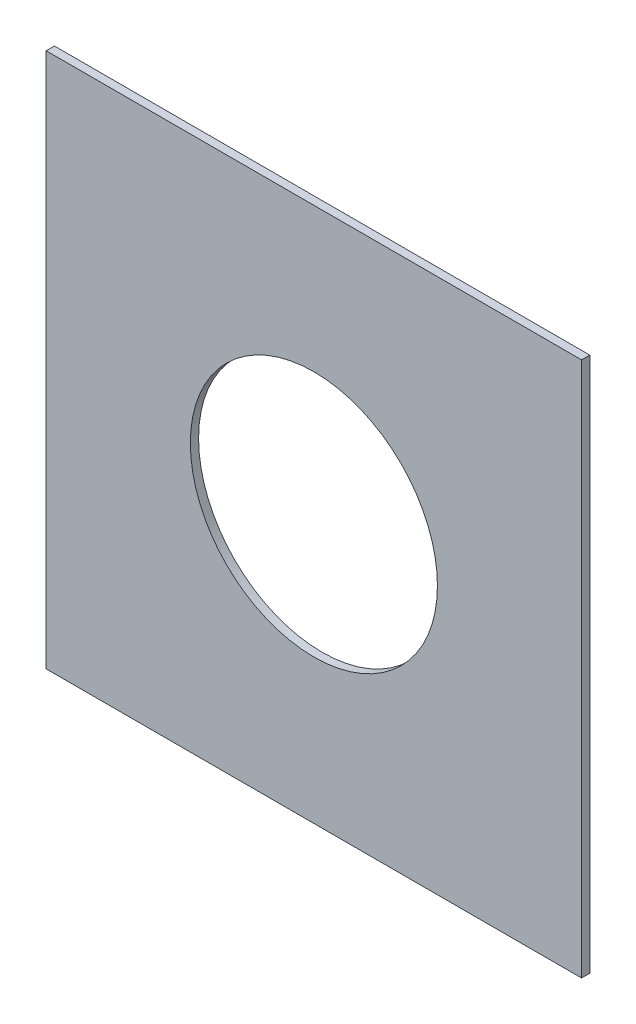
ISO-10303-21;
HEADER;
FILE_DESCRIPTION(('STEP AP214'),'2;1');
FILE_NAME('part.step','',(''),(''),'','','');
FILE_SCHEMA(('AUTOMOTIVE_DESIGN { 1 0 10303 214 1 1 1 1 }'));
ENDSEC;
DATA;
#1=APPLICATION_CONTEXT('core data for automotive mechanical design processes');
#2=APPLICATION_PROTOCOL_DEFINITION('international standard','automotive_design',2000,#1);
#3=PRODUCT_CONTEXT('',#1,'mechanical');
#4=PRODUCT('Part','Part','',(#3));
#5=PRODUCT_RELATED_PRODUCT_CATEGORY('part','',(#4));
#6=PRODUCT_DEFINITION_FORMATION('','',#4);
#7=PRODUCT_DEFINITION_CONTEXT('part definition',#1,'design');
#8=PRODUCT_DEFINITION('design','',#6,#7);
#9=PRODUCT_DEFINITION_SHAPE('','',#8);
#10=(LENGTH_UNIT() NAMED_UNIT(*) SI_UNIT(.MILLI.,.METRE.));
#11=(NAMED_UNIT(*) PLANE_ANGLE_UNIT() SI_UNIT($,.RADIAN.));
#12=(NAMED_UNIT(*) SI_UNIT($,.STERADIAN.) SOLID_ANGLE_UNIT());
#13=UNCERTAINTY_MEASURE_WITH_UNIT(LENGTH_MEASURE(1.E-05),#10,'distance_accuracy_value','');
#14=(GEOMETRIC_REPRESENTATION_CONTEXT(3) GLOBAL_UNCERTAINTY_ASSIGNED_CONTEXT((#13)) GLOBAL_UNIT_ASSIGNED_CONTEXT((#10,
#11,#12)) REPRESENTATION_CONTEXT('',''));
#15=CARTESIAN_POINT('',(0.,0.,0.));
#16=DIRECTION('',(0.,0.,1.));
#17=DIRECTION('',(1.,0.,0.));
#18=AXIS2_PLACEMENT_3D('',#15,#16,#17);
#19=CARTESIAN_POINT('',(-1.876,-3.55,-6.999));
#20=DIRECTION('',(0.,1.,0.));
#21=DIRECTION('',(1.,0.,0.));
#22=AXIS2_PLACEMENT_3D('',#19,#20,#21);
#23=PLANE('',#22);
#24=DIRECTION('',(0.,0.,1.));
#25=VECTOR('',#24,1.);
#26=CARTESIAN_POINT('',(-0.575,-3.55,-7.01));
#27=LINE('',#26,#25);
#28=CARTESIAN_POINT('',(-0.575,-3.55,-7.02));
#29=VERTEX_POINT('',#28);
#30=CARTESIAN_POINT('',(-0.575,-3.55,-7.));
#31=VERTEX_POINT('',#30);
#32=EDGE_CURVE('E62',#29,#31,#27,.T.);
#33=ORIENTED_EDGE('',*,*,#32,.F.);
#34=DIRECTION('',(1.,0.,0.));
#35=VECTOR('',#34,1.);
#36=CARTESIAN_POINT('',(-1.225,-3.55,-7.02));
#37=LINE('',#36,#35);
#38=CARTESIAN_POINT('',(-1.875,-3.55,-7.02));
#39=VERTEX_POINT('',#38);
#40=EDGE_CURVE('E87',#39,#29,#37,.T.);
#41=ORIENTED_EDGE('',*,*,#40,.F.);
#42=DIRECTION('',(0.,0.,-1.));
#43=VECTOR('',#42,1.);
#44=CARTESIAN_POINT('',(-1.875,-3.55,-7.01));
#45=LINE('',#44,#43);
#46=CARTESIAN_POINT('',(-1.875,-3.55,-7.));
#47=VERTEX_POINT('',#46);
#48=EDGE_CURVE('E73',#47,#39,#45,.T.);
#49=ORIENTED_EDGE('',*,*,#48,.F.);
#50=DIRECTION('',(-1.,0.,0.));
#51=VECTOR('',#50,1.);
#52=CARTESIAN_POINT('',(-1.225,-3.55,-7.));
#53=LINE('',#52,#51);
#54=EDGE_CURVE('E56',#31,#47,#53,.T.);
#55=ORIENTED_EDGE('',*,*,#54,.F.);
#56=EDGE_LOOP('',(#33,#41,#49,#55));
#57=FACE_BOUND('',#56,.T.);
#58=ADVANCED_FACE('F17',(#57),#23,.T.);
#59=CARTESIAN_POINT('',(-0.575,-3.549,-6.999));
#60=DIRECTION('',(1.,0.,0.));
#61=DIRECTION('',(0.,-1.,0.));
#62=AXIS2_PLACEMENT_3D('',#59,#60,#61);
#63=PLANE('',#62);
#64=DIRECTION('',(0.,0.,-1.));
#65=VECTOR('',#64,1.);
#66=CARTESIAN_POINT('',(-0.575,-4.85,-7.01));
#67=LINE('',#66,#65);
#68=CARTESIAN_POINT('',(-0.575,-4.85,-7.));
#69=VERTEX_POINT('',#68);
#70=CARTESIAN_POINT('',(-0.575,-4.85,-7.02));
#71=VERTEX_POINT('',#70);
#72=EDGE_CURVE('E71',#69,#71,#67,.T.);
#73=ORIENTED_EDGE('',*,*,#72,.T.);
#74=DIRECTION('',(0.,-1.,0.));
#75=VECTOR('',#74,1.);
#76=CARTESIAN_POINT('',(-0.575,-4.2,-7.02));
#77=LINE('',#76,#75);
#78=EDGE_CURVE('E67',#29,#71,#77,.T.);
#79=ORIENTED_EDGE('',*,*,#78,.F.);
#80=ORIENTED_EDGE('',*,*,#32,.T.);
#81=DIRECTION('',(0.,1.,0.));
#82=VECTOR('',#81,1.);
#83=CARTESIAN_POINT('',(-0.575,-4.2,-7.));
#84=LINE('',#83,#82);
#85=EDGE_CURVE('E64',#69,#31,#84,.T.);
#86=ORIENTED_EDGE('',*,*,#85,.F.);
#87=EDGE_LOOP('',(#73,#79,#80,#86));
#88=FACE_BOUND('',#87,.T.);
#89=ADVANCED_FACE('F63',(#88),#63,.T.);
#90=CARTESIAN_POINT('',(-1.225,-4.2,-7.));
#91=DIRECTION('',(0.,0.,-1.));
#92=DIRECTION('',(-1.,0.,0.));
#93=AXIS2_PLACEMENT_3D('',#90,#91,#92);
#94=CYLINDRICAL_SURFACE('',#93,0.3);
#95=CARTESIAN_POINT('',(-1.225,-4.2,-7.02));
#96=DIRECTION('',(0.,0.,-1.));
#97=DIRECTION('',(-1.,0.,0.));
#98=AXIS2_PLACEMENT_3D('',#95,#96,#97);
#99=CIRCLE('',#98,0.3);
#100=CARTESIAN_POINT('',(-1.525,-4.2,-7.02));
#101=VERTEX_POINT('',#100);
#102=EDGE_CURVE('E82',#101,#101,#99,.F.);
#103=ORIENTED_EDGE('',*,*,#102,.F.);
#104=EDGE_LOOP('',(#103));
#105=FACE_BOUND('',#104,.T.);
#106=CARTESIAN_POINT('',(-1.225,-4.2,-7.));
#107=DIRECTION('',(0.,0.,-1.));
#108=DIRECTION('',(-1.,0.,0.));
#109=AXIS2_PLACEMENT_3D('',#106,#107,#108);
#110=CIRCLE('',#109,0.3);
#111=CARTESIAN_POINT('',(-1.525,-4.2,-7.));
#112=VERTEX_POINT('',#111);
#113=EDGE_CURVE('E21',#112,#112,#110,.T.);
#114=ORIENTED_EDGE('',*,*,#113,.F.);
#115=EDGE_LOOP('',(#114));
#116=FACE_BOUND('',#115,.T.);
#117=ADVANCED_FACE('F99',(#105,#116),#94,.F.);
#118=CARTESIAN_POINT('',(-0.574,-3.549,-7.));
#119=DIRECTION('',(0.,0.,1.));
#120=DIRECTION('',(-1.,0.,0.));
#121=AXIS2_PLACEMENT_3D('',#118,#119,#120);
#122=PLANE('',#121);
#123=ORIENTED_EDGE('',*,*,#113,.T.);
#124=EDGE_LOOP('',(#123));
#125=FACE_BOUND('',#124,.T.);
#126=DIRECTION('',(0.,1.,0.));
#127=VECTOR('',#126,1.);
#128=CARTESIAN_POINT('',(-1.875,-4.2,-7.));
#129=LINE('',#128,#127);
#130=CARTESIAN_POINT('',(-1.875,-4.85,-7.));
#131=VERTEX_POINT('',#130);
#132=EDGE_CURVE('E94',#131,#47,#129,.T.);
#133=ORIENTED_EDGE('',*,*,#132,.F.);
#134=DIRECTION('',(-1.,0.,0.));
#135=VECTOR('',#134,1.);
#136=CARTESIAN_POINT('',(-1.225,-4.85,-7.));
#137=LINE('',#136,#135);
#138=EDGE_CURVE('E78',#69,#131,#137,.T.);
#139=ORIENTED_EDGE('',*,*,#138,.F.);
#140=ORIENTED_EDGE('',*,*,#85,.T.);
#141=ORIENTED_EDGE('',*,*,#54,.T.);
#142=EDGE_LOOP('',(#133,#139,#140,#141));
#143=FACE_BOUND('',#142,.T.);
#144=ADVANCED_FACE('F76',(#125,#143),#122,.T.);
#145=CARTESIAN_POINT('',(-1.875,-4.851,-6.999));
#146=DIRECTION('',(-1.,0.,0.));
#147=DIRECTION('',(0.,1.,0.));
#148=AXIS2_PLACEMENT_3D('',#145,#146,#147);
#149=PLANE('',#148);
#150=ORIENTED_EDGE('',*,*,#48,.T.);
#151=DIRECTION('',(0.,1.,0.));
#152=VECTOR('',#151,1.);
#153=CARTESIAN_POINT('',(-1.875,-4.2,-7.02));
#154=LINE('',#153,#152);
#155=CARTESIAN_POINT('',(-1.875,-4.85,-7.02));
#156=VERTEX_POINT('',#155);
#157=EDGE_CURVE('E36',#156,#39,#154,.T.);
#158=ORIENTED_EDGE('',*,*,#157,.F.);
#159=DIRECTION('',(0.,0.,-1.));
#160=VECTOR('',#159,1.);
#161=CARTESIAN_POINT('',(-1.875,-4.85,-7.01));
#162=LINE('',#161,#160);
#163=EDGE_CURVE('E27',#131,#156,#162,.T.);
#164=ORIENTED_EDGE('',*,*,#163,.F.);
#165=ORIENTED_EDGE('',*,*,#132,.T.);
#166=EDGE_LOOP('',(#150,#158,#164,#165));
#167=FACE_BOUND('',#166,.T.);
#168=ADVANCED_FACE('F108',(#167),#149,.T.);
#169=CARTESIAN_POINT('',(-1.876,-3.549,-7.02));
#170=DIRECTION('',(0.,0.,-1.));
#171=DIRECTION('',(1.,0.,0.));
#172=AXIS2_PLACEMENT_3D('',#169,#170,#171);
#173=PLANE('',#172);
#174=ORIENTED_EDGE('',*,*,#102,.T.);
#175=EDGE_LOOP('',(#174));
#176=FACE_BOUND('',#175,.T.);
#177=ORIENTED_EDGE('',*,*,#40,.T.);
#178=ORIENTED_EDGE('',*,*,#78,.T.);
#179=DIRECTION('',(1.,0.,0.));
#180=VECTOR('',#179,1.);
#181=CARTESIAN_POINT('',(-1.225,-4.85,-7.02));
#182=LINE('',#181,#180);
#183=EDGE_CURVE('E11',#156,#71,#182,.T.);
#184=ORIENTED_EDGE('',*,*,#183,.F.);
#185=ORIENTED_EDGE('',*,*,#157,.T.);
#186=EDGE_LOOP('',(#177,#178,#184,#185));
#187=FACE_BOUND('',#186,.T.);
#188=ADVANCED_FACE('F112',(#176,#187),#173,.T.);
#189=CARTESIAN_POINT('',(-0.573999999999999,-4.85,-6.999));
#190=DIRECTION('',(0.,-1.,0.));
#191=DIRECTION('',(-1.,0.,0.));
#192=AXIS2_PLACEMENT_3D('',#189,#190,#191);
#193=PLANE('',#192);
#194=ORIENTED_EDGE('',*,*,#163,.T.);
#195=ORIENTED_EDGE('',*,*,#183,.T.);
#196=ORIENTED_EDGE('',*,*,#72,.F.);
#197=ORIENTED_EDGE('',*,*,#138,.T.);
#198=EDGE_LOOP('',(#194,#195,#196,#197));
#199=FACE_BOUND('',#198,.T.);
#200=ADVANCED_FACE('F19',(#199),#193,.T.);
#201=CLOSED_SHELL('',(#58,#89,#117,#144,#168,#188,#200));
#202=MANIFOLD_SOLID_BREP('B1',#201);
#203=ADVANCED_BREP_SHAPE_REPRESENTATION('',(#18,#202),#14);
#204=SHAPE_DEFINITION_REPRESENTATION(#9,#203);
ENDSEC;
END-ISO-10303-21;
